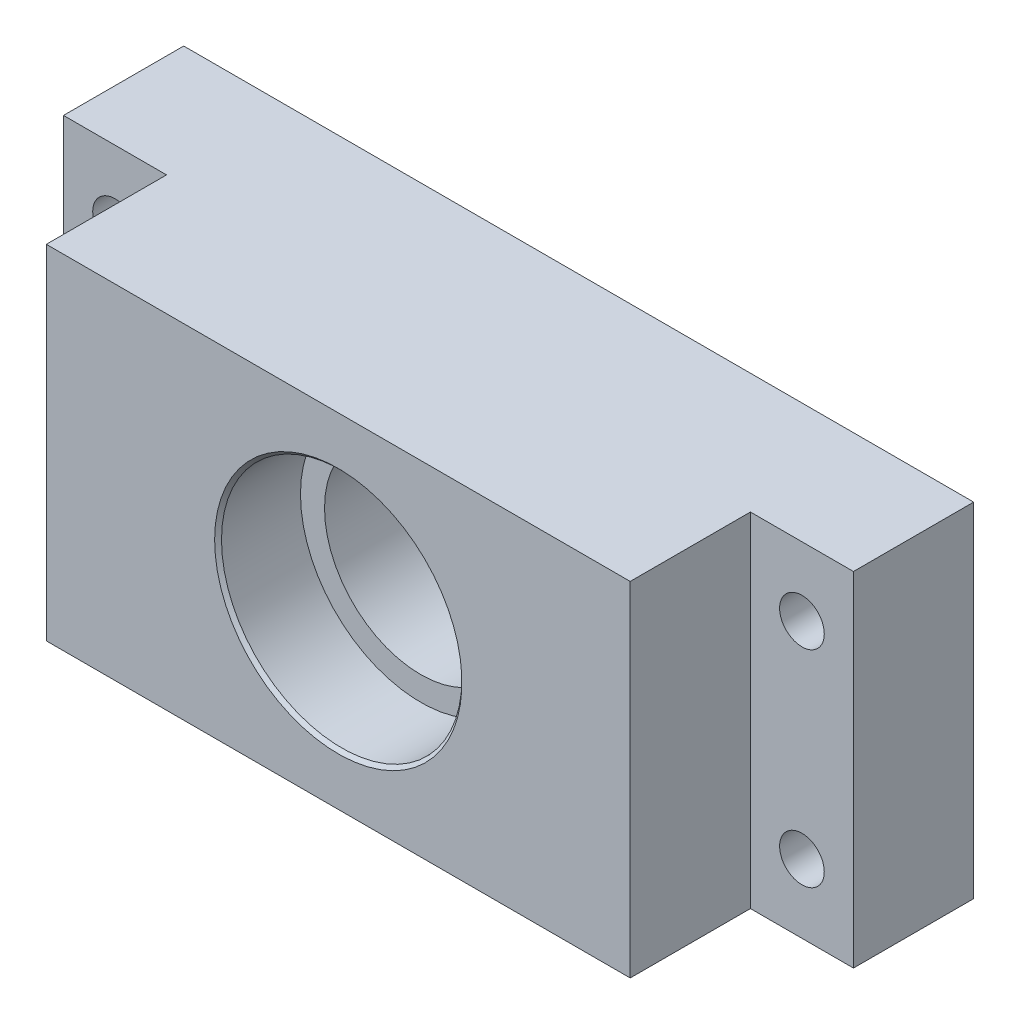
ISO-10303-21;
HEADER;
FILE_DESCRIPTION(('STEP AP214'),'2;1');
FILE_NAME('part.step','',(''),(''),'','','');
FILE_SCHEMA(('AUTOMOTIVE_DESIGN { 1 0 10303 214 1 1 1 1 }'));
ENDSEC;
DATA;
#1=APPLICATION_CONTEXT('core data for automotive mechanical design processes');
#2=APPLICATION_PROTOCOL_DEFINITION('international standard','automotive_design',2000,#1);
#3=PRODUCT_CONTEXT('',#1,'mechanical');
#4=PRODUCT('Part','Part','',(#3));
#5=PRODUCT_RELATED_PRODUCT_CATEGORY('part','',(#4));
#6=PRODUCT_DEFINITION_FORMATION('','',#4);
#7=PRODUCT_DEFINITION_CONTEXT('part definition',#1,'design');
#8=PRODUCT_DEFINITION('design','',#6,#7);
#9=PRODUCT_DEFINITION_SHAPE('','',#8);
#10=(LENGTH_UNIT() NAMED_UNIT(*) SI_UNIT(.MILLI.,.METRE.));
#11=(NAMED_UNIT(*) PLANE_ANGLE_UNIT() SI_UNIT($,.RADIAN.));
#12=(NAMED_UNIT(*) SI_UNIT($,.STERADIAN.) SOLID_ANGLE_UNIT());
#13=UNCERTAINTY_MEASURE_WITH_UNIT(LENGTH_MEASURE(1.E-05),#10,'distance_accuracy_value','');
#14=(GEOMETRIC_REPRESENTATION_CONTEXT(3) GLOBAL_UNCERTAINTY_ASSIGNED_CONTEXT((#13)) GLOBAL_UNIT_ASSIGNED_CONTEXT((#10,
#11,#12)) REPRESENTATION_CONTEXT('',''));
#15=CARTESIAN_POINT('',(0.,0.,0.));
#16=DIRECTION('',(0.,0.,1.));
#17=DIRECTION('',(1.,0.,0.));
#18=AXIS2_PLACEMENT_3D('',#15,#16,#17);
#19=CARTESIAN_POINT('',(57.5,-25.,35.));
#20=DIRECTION('',(-1.,0.,0.));
#21=DIRECTION('',(0.,0.,1.));
#22=AXIS2_PLACEMENT_3D('',#19,#20,#21);
#23=PLANE('',#22);
#24=DIRECTION('',(0.,1.,0.));
#25=VECTOR('',#24,1.);
#26=CARTESIAN_POINT('',(57.5,-25.,17.5));
#27=LINE('',#26,#25);
#28=CARTESIAN_POINT('',(57.5,-25.,17.5));
#29=VERTEX_POINT('',#28);
#30=CARTESIAN_POINT('',(57.5,25.,17.5));
#31=VERTEX_POINT('',#30);
#32=EDGE_CURVE('E113',#29,#31,#27,.T.);
#33=ORIENTED_EDGE('',*,*,#32,.F.);
#34=DIRECTION('',(0.,0.,-1.));
#35=VECTOR('',#34,1.);
#36=CARTESIAN_POINT('',(57.5,-25.,35.));
#37=LINE('',#36,#35);
#38=CARTESIAN_POINT('',(57.5,-25.,0.));
#39=VERTEX_POINT('',#38);
#40=EDGE_CURVE('E174',#29,#39,#37,.T.);
#41=ORIENTED_EDGE('',*,*,#40,.T.);
#42=DIRECTION('',(0.,1.,0.));
#43=VECTOR('',#42,1.);
#44=CARTESIAN_POINT('',(57.5,-25.,0.));
#45=LINE('',#44,#43);
#46=CARTESIAN_POINT('',(57.5,25.,0.));
#47=VERTEX_POINT('',#46);
#48=EDGE_CURVE('E136',#39,#47,#45,.T.);
#49=ORIENTED_EDGE('',*,*,#48,.T.);
#50=DIRECTION('',(0.,0.,-1.));
#51=VECTOR('',#50,1.);
#52=CARTESIAN_POINT('',(57.5,25.,35.));
#53=LINE('',#52,#51);
#54=EDGE_CURVE('E130',#31,#47,#53,.T.);
#55=ORIENTED_EDGE('',*,*,#54,.F.);
#56=EDGE_LOOP('',(#33,#41,#49,#55));
#57=FACE_BOUND('',#56,.T.);
#58=ADVANCED_FACE('F48',(#57),#23,.F.);
#59=CARTESIAN_POINT('',(50.,15.,35.));
#60=DIRECTION('',(0.,0.,-1.));
#61=DIRECTION('',(-1.,0.,0.));
#62=AXIS2_PLACEMENT_3D('',#59,#60,#61);
#63=CYLINDRICAL_SURFACE('',#62,3.25);
#64=CARTESIAN_POINT('',(50.,15.,0.));
#65=DIRECTION('',(0.,0.,-1.));
#66=DIRECTION('',(-1.,0.,0.));
#67=AXIS2_PLACEMENT_3D('',#64,#65,#66);
#68=CIRCLE('',#67,3.25);
#69=CARTESIAN_POINT('',(46.75,15.,0.));
#70=VERTEX_POINT('',#69);
#71=EDGE_CURVE('E236',#70,#70,#68,.T.);
#72=ORIENTED_EDGE('',*,*,#71,.T.);
#73=EDGE_LOOP('',(#72));
#74=FACE_BOUND('',#73,.T.);
#75=CARTESIAN_POINT('',(50.,15.,17.5));
#76=DIRECTION('',(0.,0.,1.));
#77=DIRECTION('',(1.,0.,0.));
#78=AXIS2_PLACEMENT_3D('',#75,#76,#77);
#79=CIRCLE('',#78,3.25);
#80=CARTESIAN_POINT('',(53.25,15.,17.5));
#81=VERTEX_POINT('',#80);
#82=EDGE_CURVE('E464',#81,#81,#79,.F.);
#83=ORIENTED_EDGE('',*,*,#82,.F.);
#84=EDGE_LOOP('',(#83));
#85=FACE_BOUND('',#84,.T.);
#86=ADVANCED_FACE('F263',(#74,#85),#63,.F.);
#87=CARTESIAN_POINT('',(50.,-15.,35.));
#88=DIRECTION('',(0.,0.,-1.));
#89=DIRECTION('',(-1.,0.,0.));
#90=AXIS2_PLACEMENT_3D('',#87,#88,#89);
#91=CYLINDRICAL_SURFACE('',#90,3.25);
#92=CARTESIAN_POINT('',(50.,-15.,0.));
#93=DIRECTION('',(0.,0.,-1.));
#94=DIRECTION('',(-1.,0.,0.));
#95=AXIS2_PLACEMENT_3D('',#92,#93,#94);
#96=CIRCLE('',#95,3.25);
#97=CARTESIAN_POINT('',(46.75,-15.,0.));
#98=VERTEX_POINT('',#97);
#99=EDGE_CURVE('E241',#98,#98,#96,.T.);
#100=ORIENTED_EDGE('',*,*,#99,.T.);
#101=EDGE_LOOP('',(#100));
#102=FACE_BOUND('',#101,.T.);
#103=CARTESIAN_POINT('',(50.,-15.,17.5));
#104=DIRECTION('',(0.,0.,1.));
#105=DIRECTION('',(1.,0.,0.));
#106=AXIS2_PLACEMENT_3D('',#103,#104,#105);
#107=CIRCLE('',#106,3.25);
#108=CARTESIAN_POINT('',(53.25,-15.,17.5));
#109=VERTEX_POINT('',#108);
#110=EDGE_CURVE('E461',#109,#109,#107,.F.);
#111=ORIENTED_EDGE('',*,*,#110,.F.);
#112=EDGE_LOOP('',(#111));
#113=FACE_BOUND('',#112,.T.);
#114=ADVANCED_FACE('F268',(#102,#113),#91,.F.);
#115=CARTESIAN_POINT('',(0.,0.,35.));
#116=DIRECTION('',(0.,0.,-1.));
#117=DIRECTION('',(-1.,0.,0.));
#118=AXIS2_PLACEMENT_3D('',#115,#116,#117);
#119=CYLINDRICAL_SURFACE('',#118,14.);
#120=CARTESIAN_POINT('',(0.,0.,23.));
#121=DIRECTION('',(0.,0.,1.));
#122=DIRECTION('',(1.,0.,0.));
#123=AXIS2_PLACEMENT_3D('',#120,#121,#122);
#124=CIRCLE('',#123,14.);
#125=CARTESIAN_POINT('',(14.,0.,23.));
#126=VERTEX_POINT('',#125);
#127=EDGE_CURVE('E151',#126,#126,#124,.T.);
#128=ORIENTED_EDGE('',*,*,#127,.T.);
#129=EDGE_LOOP('',(#128));
#130=FACE_BOUND('',#129,.T.);
#131=CARTESIAN_POINT('',(0.,0.,12.));
#132=DIRECTION('',(0.,0.,-1.));
#133=DIRECTION('',(-1.,0.,0.));
#134=AXIS2_PLACEMENT_3D('',#131,#132,#133);
#135=CIRCLE('',#134,14.);
#136=CARTESIAN_POINT('',(-14.,0.,12.));
#137=VERTEX_POINT('',#136);
#138=EDGE_CURVE('E232',#137,#137,#135,.T.);
#139=ORIENTED_EDGE('',*,*,#138,.T.);
#140=EDGE_LOOP('',(#139));
#141=FACE_BOUND('',#140,.T.);
#142=ADVANCED_FACE('F289',(#130,#141),#119,.F.);
#143=CARTESIAN_POINT('',(0.,0.,35.));
#144=DIRECTION('',(0.,0.,-1.));
#145=DIRECTION('',(-1.,0.,0.));
#146=AXIS2_PLACEMENT_3D('',#143,#144,#145);
#147=PLANE('',#146);
#148=CARTESIAN_POINT('',(0.,0.,35.));
#149=DIRECTION('',(0.,0.,-1.));
#150=DIRECTION('',(-1.,0.,0.));
#151=AXIS2_PLACEMENT_3D('',#148,#149,#150);
#152=CIRCLE('',#151,18.);
#153=CARTESIAN_POINT('',(-18.,0.,35.));
#154=VERTEX_POINT('',#153);
#155=EDGE_CURVE('E144',#154,#154,#152,.T.);
#156=ORIENTED_EDGE('',*,*,#155,.T.);
#157=EDGE_LOOP('',(#156));
#158=FACE_BOUND('',#157,.T.);
#159=DIRECTION('',(1.,0.,0.));
#160=VECTOR('',#159,1.);
#161=CARTESIAN_POINT('',(-57.5,-25.,35.));
#162=LINE('',#161,#160);
#163=CARTESIAN_POINT('',(-42.5,-25.,35.));
#164=VERTEX_POINT('',#163);
#165=CARTESIAN_POINT('',(42.5,-25.,35.));
#166=VERTEX_POINT('',#165);
#167=EDGE_CURVE('E162',#164,#166,#162,.T.);
#168=ORIENTED_EDGE('',*,*,#167,.T.);
#169=DIRECTION('',(0.,-1.,0.));
#170=VECTOR('',#169,1.);
#171=CARTESIAN_POINT('',(42.5,-25.,35.));
#172=LINE('',#171,#170);
#173=CARTESIAN_POINT('',(42.5,25.,35.));
#174=VERTEX_POINT('',#173);
#175=EDGE_CURVE('E124',#174,#166,#172,.T.);
#176=ORIENTED_EDGE('',*,*,#175,.F.);
#177=DIRECTION('',(-1.,0.,0.));
#178=VECTOR('',#177,1.);
#179=CARTESIAN_POINT('',(-57.5,25.,35.));
#180=LINE('',#179,#178);
#181=CARTESIAN_POINT('',(-42.5,25.,35.));
#182=VERTEX_POINT('',#181);
#183=EDGE_CURVE('E173',#174,#182,#180,.T.);
#184=ORIENTED_EDGE('',*,*,#183,.T.);
#185=DIRECTION('',(0.,1.,0.));
#186=VECTOR('',#185,1.);
#187=CARTESIAN_POINT('',(-42.5,-25.,35.));
#188=LINE('',#187,#186);
#189=EDGE_CURVE('E204',#164,#182,#188,.T.);
#190=ORIENTED_EDGE('',*,*,#189,.F.);
#191=EDGE_LOOP('',(#168,#176,#184,#190));
#192=FACE_BOUND('',#191,.T.);
#193=ADVANCED_FACE('F225',(#158,#192),#147,.F.);
#194=CARTESIAN_POINT('',(0.,0.,0.));
#195=DIRECTION('',(0.,0.,-1.));
#196=DIRECTION('',(-1.,0.,0.));
#197=AXIS2_PLACEMENT_3D('',#194,#195,#196);
#198=PLANE('',#197);
#199=CARTESIAN_POINT('',(0.,0.,0.));
#200=DIRECTION('',(0.,0.,-1.));
#201=DIRECTION('',(-1.,0.,0.));
#202=AXIS2_PLACEMENT_3D('',#199,#200,#201);
#203=CIRCLE('',#202,18.);
#204=CARTESIAN_POINT('',(-18.,0.,0.));
#205=VERTEX_POINT('',#204);
#206=EDGE_CURVE('E12',#205,#205,#203,.F.);
#207=ORIENTED_EDGE('',*,*,#206,.T.);
#208=EDGE_LOOP('',(#207));
#209=FACE_BOUND('',#208,.T.);
#210=ORIENTED_EDGE('',*,*,#99,.F.);
#211=EDGE_LOOP('',(#210));
#212=FACE_BOUND('',#211,.T.);
#213=CARTESIAN_POINT('',(-50.,15.,0.));
#214=DIRECTION('',(0.,0.,-1.));
#215=DIRECTION('',(-1.,0.,0.));
#216=AXIS2_PLACEMENT_3D('',#213,#214,#215);
#217=CIRCLE('',#216,3.25);
#218=CARTESIAN_POINT('',(-53.25,15.,0.));
#219=VERTEX_POINT('',#218);
#220=EDGE_CURVE('E242',#219,#219,#217,.T.);
#221=ORIENTED_EDGE('',*,*,#220,.F.);
#222=EDGE_LOOP('',(#221));
#223=FACE_BOUND('',#222,.T.);
#224=CARTESIAN_POINT('',(-50.,-15.,0.));
#225=DIRECTION('',(0.,0.,-1.));
#226=DIRECTION('',(-1.,0.,0.));
#227=AXIS2_PLACEMENT_3D('',#224,#225,#226);
#228=CIRCLE('',#227,3.25);
#229=CARTESIAN_POINT('',(-53.25,-15.,0.));
#230=VERTEX_POINT('',#229);
#231=EDGE_CURVE('E479',#230,#230,#228,.T.);
#232=ORIENTED_EDGE('',*,*,#231,.F.);
#233=EDGE_LOOP('',(#232));
#234=FACE_BOUND('',#233,.T.);
#235=ORIENTED_EDGE('',*,*,#71,.F.);
#236=EDGE_LOOP('',(#235));
#237=FACE_BOUND('',#236,.T.);
#238=ORIENTED_EDGE('',*,*,#48,.F.);
#239=DIRECTION('',(1.,0.,0.));
#240=VECTOR('',#239,1.);
#241=CARTESIAN_POINT('',(-57.5,-25.,0.));
#242=LINE('',#241,#240);
#243=CARTESIAN_POINT('',(-57.5,-25.,0.));
#244=VERTEX_POINT('',#243);
#245=EDGE_CURVE('E168',#244,#39,#242,.T.);
#246=ORIENTED_EDGE('',*,*,#245,.F.);
#247=DIRECTION('',(0.,-1.,0.));
#248=VECTOR('',#247,1.);
#249=CARTESIAN_POINT('',(-57.5,-25.,0.));
#250=LINE('',#249,#248);
#251=CARTESIAN_POINT('',(-57.5,25.,0.));
#252=VERTEX_POINT('',#251);
#253=EDGE_CURVE('E165',#252,#244,#250,.T.);
#254=ORIENTED_EDGE('',*,*,#253,.F.);
#255=DIRECTION('',(-1.,0.,0.));
#256=VECTOR('',#255,1.);
#257=CARTESIAN_POINT('',(-57.5,25.,0.));
#258=LINE('',#257,#256);
#259=EDGE_CURVE('E161',#47,#252,#258,.T.);
#260=ORIENTED_EDGE('',*,*,#259,.F.);
#261=EDGE_LOOP('',(#238,#246,#254,#260));
#262=FACE_BOUND('',#261,.T.);
#263=ADVANCED_FACE('F189',(#209,#212,#223,#234,#237,#262),#198,.T.);
#264=CARTESIAN_POINT('',(-57.5,25.,35.));
#265=DIRECTION('',(0.,-1.,0.));
#266=DIRECTION('',(0.,0.,-1.));
#267=AXIS2_PLACEMENT_3D('',#264,#265,#266);
#268=PLANE('',#267);
#269=ORIENTED_EDGE('',*,*,#183,.F.);
#270=DIRECTION('',(0.,0.,1.));
#271=VECTOR('',#270,1.);
#272=CARTESIAN_POINT('',(42.5,25.,17.5));
#273=LINE('',#272,#271);
#274=CARTESIAN_POINT('',(42.5,25.,17.5));
#275=VERTEX_POINT('',#274);
#276=EDGE_CURVE('E132',#275,#174,#273,.T.);
#277=ORIENTED_EDGE('',*,*,#276,.F.);
#278=DIRECTION('',(-1.,0.,0.));
#279=VECTOR('',#278,1.);
#280=CARTESIAN_POINT('',(57.5,25.,17.5));
#281=LINE('',#280,#279);
#282=EDGE_CURVE('E117',#31,#275,#281,.T.);
#283=ORIENTED_EDGE('',*,*,#282,.F.);
#284=ORIENTED_EDGE('',*,*,#54,.T.);
#285=ORIENTED_EDGE('',*,*,#259,.T.);
#286=DIRECTION('',(0.,0.,-1.));
#287=VECTOR('',#286,1.);
#288=CARTESIAN_POINT('',(-57.5,25.,35.));
#289=LINE('',#288,#287);
#290=CARTESIAN_POINT('',(-57.5,25.,17.5));
#291=VERTEX_POINT('',#290);
#292=EDGE_CURVE('E139',#291,#252,#289,.T.);
#293=ORIENTED_EDGE('',*,*,#292,.F.);
#294=DIRECTION('',(-1.,0.,0.));
#295=VECTOR('',#294,1.);
#296=CARTESIAN_POINT('',(-57.5,25.,17.5));
#297=LINE('',#296,#295);
#298=CARTESIAN_POINT('',(-42.5,25.,17.5));
#299=VERTEX_POINT('',#298);
#300=EDGE_CURVE('E192',#299,#291,#297,.T.);
#301=ORIENTED_EDGE('',*,*,#300,.F.);
#302=DIRECTION('',(0.,0.,1.));
#303=VECTOR('',#302,1.);
#304=CARTESIAN_POINT('',(-42.5,25.,17.5));
#305=LINE('',#304,#303);
#306=EDGE_CURVE('E193',#299,#182,#305,.T.);
#307=ORIENTED_EDGE('',*,*,#306,.T.);
#308=EDGE_LOOP('',(#269,#277,#283,#284,#285,#293,#301,#307));
#309=FACE_BOUND('',#308,.T.);
#310=ADVANCED_FACE('F128',(#309),#268,.F.);
#311=CARTESIAN_POINT('',(-57.5,-25.,35.));
#312=DIRECTION('',(1.,0.,0.));
#313=DIRECTION('',(0.,0.,-1.));
#314=AXIS2_PLACEMENT_3D('',#311,#312,#313);
#315=PLANE('',#314);
#316=DIRECTION('',(0.,0.,-1.));
#317=VECTOR('',#316,1.);
#318=CARTESIAN_POINT('',(-57.5,-25.,35.));
#319=LINE('',#318,#317);
#320=CARTESIAN_POINT('',(-57.5,-25.,17.5));
#321=VERTEX_POINT('',#320);
#322=EDGE_CURVE('E146',#321,#244,#319,.T.);
#323=ORIENTED_EDGE('',*,*,#322,.F.);
#324=DIRECTION('',(0.,-1.,0.));
#325=VECTOR('',#324,1.);
#326=CARTESIAN_POINT('',(-57.5,-25.,17.5));
#327=LINE('',#326,#325);
#328=EDGE_CURVE('E72',#291,#321,#327,.T.);
#329=ORIENTED_EDGE('',*,*,#328,.F.);
#330=ORIENTED_EDGE('',*,*,#292,.T.);
#331=ORIENTED_EDGE('',*,*,#253,.T.);
#332=EDGE_LOOP('',(#323,#329,#330,#331));
#333=FACE_BOUND('',#332,.T.);
#334=ADVANCED_FACE('F186',(#333),#315,.F.);
#335=CARTESIAN_POINT('',(-57.5,-25.,35.));
#336=DIRECTION('',(0.,1.,0.));
#337=DIRECTION('',(0.,0.,1.));
#338=AXIS2_PLACEMENT_3D('',#335,#336,#337);
#339=PLANE('',#338);
#340=DIRECTION('',(1.,0.,0.));
#341=VECTOR('',#340,1.);
#342=CARTESIAN_POINT('',(57.5,-25.,17.5));
#343=LINE('',#342,#341);
#344=CARTESIAN_POINT('',(42.5,-25.,17.5));
#345=VERTEX_POINT('',#344);
#346=EDGE_CURVE('E120',#345,#29,#343,.T.);
#347=ORIENTED_EDGE('',*,*,#346,.F.);
#348=DIRECTION('',(0.,0.,1.));
#349=VECTOR('',#348,1.);
#350=CARTESIAN_POINT('',(42.5,-25.,17.5));
#351=LINE('',#350,#349);
#352=EDGE_CURVE('E459',#345,#166,#351,.T.);
#353=ORIENTED_EDGE('',*,*,#352,.T.);
#354=ORIENTED_EDGE('',*,*,#167,.F.);
#355=DIRECTION('',(0.,0.,1.));
#356=VECTOR('',#355,1.);
#357=CARTESIAN_POINT('',(-42.5,-25.,17.5));
#358=LINE('',#357,#356);
#359=CARTESIAN_POINT('',(-42.5,-25.,17.5));
#360=VERTEX_POINT('',#359);
#361=EDGE_CURVE('E196',#360,#164,#358,.T.);
#362=ORIENTED_EDGE('',*,*,#361,.F.);
#363=DIRECTION('',(1.,0.,0.));
#364=VECTOR('',#363,1.);
#365=CARTESIAN_POINT('',(-57.5,-25.,17.5));
#366=LINE('',#365,#364);
#367=EDGE_CURVE('E183',#321,#360,#366,.T.);
#368=ORIENTED_EDGE('',*,*,#367,.F.);
#369=ORIENTED_EDGE('',*,*,#322,.T.);
#370=ORIENTED_EDGE('',*,*,#245,.T.);
#371=ORIENTED_EDGE('',*,*,#40,.F.);
#372=EDGE_LOOP('',(#347,#353,#354,#362,#368,#369,#370,#371));
#373=FACE_BOUND('',#372,.T.);
#374=ADVANCED_FACE('F180',(#373),#339,.F.);
#375=CARTESIAN_POINT('',(0.,0.,23.));
#376=DIRECTION('',(0.,0.,1.));
#377=DIRECTION('',(1.,0.,0.));
#378=AXIS2_PLACEMENT_3D('',#375,#376,#377);
#379=CYLINDRICAL_SURFACE('',#378,17.5);
#380=CARTESIAN_POINT('',(0.,0.,34.5));
#381=DIRECTION('',(0.,0.,-1.));
#382=DIRECTION('',(-1.,0.,0.));
#383=AXIS2_PLACEMENT_3D('',#380,#381,#382);
#384=CIRCLE('',#383,17.5);
#385=CARTESIAN_POINT('',(-17.5,0.,34.5));
#386=VERTEX_POINT('',#385);
#387=EDGE_CURVE('E138',#386,#386,#384,.F.);
#388=ORIENTED_EDGE('',*,*,#387,.T.);
#389=EDGE_LOOP('',(#388));
#390=FACE_BOUND('',#389,.T.);
#391=CARTESIAN_POINT('',(0.,0.,23.));
#392=DIRECTION('',(0.,0.,1.));
#393=DIRECTION('',(1.,0.,0.));
#394=AXIS2_PLACEMENT_3D('',#391,#392,#393);
#395=CIRCLE('',#394,17.5);
#396=CARTESIAN_POINT('',(17.5,0.,23.));
#397=VERTEX_POINT('',#396);
#398=EDGE_CURVE('E228',#397,#397,#395,.T.);
#399=ORIENTED_EDGE('',*,*,#398,.F.);
#400=EDGE_LOOP('',(#399));
#401=FACE_BOUND('',#400,.T.);
#402=ADVANCED_FACE('F283',(#390,#401),#379,.F.);
#403=CARTESIAN_POINT('',(0.,0.,23.));
#404=DIRECTION('',(0.,0.,1.));
#405=DIRECTION('',(1.,0.,0.));
#406=AXIS2_PLACEMENT_3D('',#403,#404,#405);
#407=PLANE('',#406);
#408=ORIENTED_EDGE('',*,*,#127,.F.);
#409=EDGE_LOOP('',(#408));
#410=FACE_BOUND('',#409,.T.);
#411=ORIENTED_EDGE('',*,*,#398,.T.);
#412=EDGE_LOOP('',(#411));
#413=FACE_BOUND('',#412,.T.);
#414=ADVANCED_FACE('F296',(#410,#413),#407,.T.);
#415=CARTESIAN_POINT('',(0.,0.,12.));
#416=DIRECTION('',(0.,0.,-1.));
#417=DIRECTION('',(-1.,0.,0.));
#418=AXIS2_PLACEMENT_3D('',#415,#416,#417);
#419=CYLINDRICAL_SURFACE('',#418,17.5);
#420=CARTESIAN_POINT('',(0.,0.,0.5));
#421=DIRECTION('',(0.,0.,-1.));
#422=DIRECTION('',(-1.,0.,0.));
#423=AXIS2_PLACEMENT_3D('',#420,#421,#422);
#424=CIRCLE('',#423,17.5);
#425=CARTESIAN_POINT('',(-17.5,0.,0.5));
#426=VERTEX_POINT('',#425);
#427=EDGE_CURVE('E57',#426,#426,#424,.T.);
#428=ORIENTED_EDGE('',*,*,#427,.T.);
#429=EDGE_LOOP('',(#428));
#430=FACE_BOUND('',#429,.T.);
#431=CARTESIAN_POINT('',(0.,0.,12.));
#432=DIRECTION('',(0.,0.,-1.));
#433=DIRECTION('',(-1.,0.,0.));
#434=AXIS2_PLACEMENT_3D('',#431,#432,#433);
#435=CIRCLE('',#434,17.5);
#436=CARTESIAN_POINT('',(-17.5,0.,12.));
#437=VERTEX_POINT('',#436);
#438=EDGE_CURVE('E233',#437,#437,#435,.T.);
#439=ORIENTED_EDGE('',*,*,#438,.F.);
#440=EDGE_LOOP('',(#439));
#441=FACE_BOUND('',#440,.T.);
#442=ADVANCED_FACE('F251',(#430,#441),#419,.F.);
#443=CARTESIAN_POINT('',(0.,0.,12.));
#444=DIRECTION('',(0.,0.,-1.));
#445=DIRECTION('',(-1.,0.,0.));
#446=AXIS2_PLACEMENT_3D('',#443,#444,#445);
#447=PLANE('',#446);
#448=ORIENTED_EDGE('',*,*,#138,.F.);
#449=EDGE_LOOP('',(#448));
#450=FACE_BOUND('',#449,.T.);
#451=ORIENTED_EDGE('',*,*,#438,.T.);
#452=EDGE_LOOP('',(#451));
#453=FACE_BOUND('',#452,.T.);
#454=ADVANCED_FACE('F303',(#450,#453),#447,.T.);
#455=CARTESIAN_POINT('',(-50.,-15.,35.));
#456=DIRECTION('',(0.,0.,-1.));
#457=DIRECTION('',(-1.,0.,0.));
#458=AXIS2_PLACEMENT_3D('',#455,#456,#457);
#459=CYLINDRICAL_SURFACE('',#458,3.25);
#460=CARTESIAN_POINT('',(-50.,-15.,17.5));
#461=DIRECTION('',(0.,0.,-1.));
#462=DIRECTION('',(-1.,0.,0.));
#463=AXIS2_PLACEMENT_3D('',#460,#461,#462);
#464=CIRCLE('',#463,3.25);
#465=CARTESIAN_POINT('',(-53.25,-15.,17.5));
#466=VERTEX_POINT('',#465);
#467=EDGE_CURVE('E475',#466,#466,#464,.F.);
#468=ORIENTED_EDGE('',*,*,#467,.T.);
#469=EDGE_LOOP('',(#468));
#470=FACE_BOUND('',#469,.T.);
#471=ORIENTED_EDGE('',*,*,#231,.T.);
#472=EDGE_LOOP('',(#471));
#473=FACE_BOUND('',#472,.T.);
#474=ADVANCED_FACE('F305',(#470,#473),#459,.F.);
#475=CARTESIAN_POINT('',(-50.,15.,35.));
#476=DIRECTION('',(0.,0.,-1.));
#477=DIRECTION('',(-1.,0.,0.));
#478=AXIS2_PLACEMENT_3D('',#475,#476,#477);
#479=CYLINDRICAL_SURFACE('',#478,3.25);
#480=CARTESIAN_POINT('',(-50.,15.,17.5));
#481=DIRECTION('',(0.,0.,-1.));
#482=DIRECTION('',(-1.,0.,0.));
#483=AXIS2_PLACEMENT_3D('',#480,#481,#482);
#484=CIRCLE('',#483,3.25);
#485=CARTESIAN_POINT('',(-53.25,15.,17.5));
#486=VERTEX_POINT('',#485);
#487=EDGE_CURVE('E471',#486,#486,#484,.F.);
#488=ORIENTED_EDGE('',*,*,#487,.T.);
#489=EDGE_LOOP('',(#488));
#490=FACE_BOUND('',#489,.T.);
#491=ORIENTED_EDGE('',*,*,#220,.T.);
#492=EDGE_LOOP('',(#491));
#493=FACE_BOUND('',#492,.T.);
#494=ADVANCED_FACE('F308',(#490,#493),#479,.F.);
#495=CARTESIAN_POINT('',(0.,0.,17.5));
#496=DIRECTION('',(0.,0.,1.));
#497=DIRECTION('',(1.,0.,0.));
#498=AXIS2_PLACEMENT_3D('',#495,#496,#497);
#499=PLANE('',#498);
#500=ORIENTED_EDGE('',*,*,#32,.T.);
#501=ORIENTED_EDGE('',*,*,#282,.T.);
#502=DIRECTION('',(0.,-1.,0.));
#503=VECTOR('',#502,1.);
#504=CARTESIAN_POINT('',(42.5,-25.,17.5));
#505=LINE('',#504,#503);
#506=EDGE_CURVE('E64',#275,#345,#505,.T.);
#507=ORIENTED_EDGE('',*,*,#506,.T.);
#508=ORIENTED_EDGE('',*,*,#346,.T.);
#509=EDGE_LOOP('',(#500,#501,#507,#508));
#510=FACE_BOUND('',#509,.T.);
#511=ORIENTED_EDGE('',*,*,#110,.T.);
#512=EDGE_LOOP('',(#511));
#513=FACE_BOUND('',#512,.T.);
#514=ORIENTED_EDGE('',*,*,#82,.T.);
#515=EDGE_LOOP('',(#514));
#516=FACE_BOUND('',#515,.T.);
#517=ADVANCED_FACE('F115',(#510,#513,#516),#499,.T.);
#518=CARTESIAN_POINT('',(42.5,-25.,17.5));
#519=DIRECTION('',(-1.,0.,0.));
#520=DIRECTION('',(0.,0.,1.));
#521=AXIS2_PLACEMENT_3D('',#518,#519,#520);
#522=PLANE('',#521);
#523=ORIENTED_EDGE('',*,*,#175,.T.);
#524=ORIENTED_EDGE('',*,*,#352,.F.);
#525=ORIENTED_EDGE('',*,*,#506,.F.);
#526=ORIENTED_EDGE('',*,*,#276,.T.);
#527=EDGE_LOOP('',(#523,#524,#525,#526));
#528=FACE_BOUND('',#527,.T.);
#529=ADVANCED_FACE('F322',(#528),#522,.F.);
#530=CARTESIAN_POINT('',(0.,0.,17.5));
#531=DIRECTION('',(0.,0.,-1.));
#532=DIRECTION('',(-1.,0.,0.));
#533=AXIS2_PLACEMENT_3D('',#530,#531,#532);
#534=PLANE('',#533);
#535=ORIENTED_EDGE('',*,*,#487,.F.);
#536=EDGE_LOOP('',(#535));
#537=FACE_BOUND('',#536,.T.);
#538=ORIENTED_EDGE('',*,*,#328,.T.);
#539=ORIENTED_EDGE('',*,*,#367,.T.);
#540=DIRECTION('',(0.,1.,0.));
#541=VECTOR('',#540,1.);
#542=CARTESIAN_POINT('',(-42.5,-25.,17.5));
#543=LINE('',#542,#541);
#544=EDGE_CURVE('E197',#360,#299,#543,.T.);
#545=ORIENTED_EDGE('',*,*,#544,.T.);
#546=ORIENTED_EDGE('',*,*,#300,.T.);
#547=EDGE_LOOP('',(#538,#539,#545,#546));
#548=FACE_BOUND('',#547,.T.);
#549=ORIENTED_EDGE('',*,*,#467,.F.);
#550=EDGE_LOOP('',(#549));
#551=FACE_BOUND('',#550,.T.);
#552=ADVANCED_FACE('F216',(#537,#548,#551),#534,.F.);
#553=CARTESIAN_POINT('',(-42.5,-25.,17.5));
#554=DIRECTION('',(1.,0.,0.));
#555=DIRECTION('',(0.,0.,-1.));
#556=AXIS2_PLACEMENT_3D('',#553,#554,#555);
#557=PLANE('',#556);
#558=ORIENTED_EDGE('',*,*,#189,.T.);
#559=ORIENTED_EDGE('',*,*,#306,.F.);
#560=ORIENTED_EDGE('',*,*,#544,.F.);
#561=ORIENTED_EDGE('',*,*,#361,.T.);
#562=EDGE_LOOP('',(#558,#559,#560,#561));
#563=FACE_BOUND('',#562,.T.);
#564=ADVANCED_FACE('F223',(#563),#557,.F.);
#565=CARTESIAN_POINT('',(0.,0.,34.5));
#566=DIRECTION('',(0.,0.,1.));
#567=DIRECTION('',(1.,0.,0.));
#568=AXIS2_PLACEMENT_3D('',#565,#566,#567);
#569=CONICAL_SURFACE('',#568,17.5,0.785398163397452);
#570=ORIENTED_EDGE('',*,*,#155,.F.);
#571=EDGE_LOOP('',(#570));
#572=FACE_BOUND('',#571,.T.);
#573=ORIENTED_EDGE('',*,*,#387,.F.);
#574=EDGE_LOOP('',(#573));
#575=FACE_BOUND('',#574,.T.);
#576=ADVANCED_FACE('F255',(#572,#575),#569,.F.);
#577=CARTESIAN_POINT('',(0.,0.,0.5));
#578=DIRECTION('',(0.,0.,-1.));
#579=DIRECTION('',(-1.,0.,0.));
#580=AXIS2_PLACEMENT_3D('',#577,#578,#579);
#581=CONICAL_SURFACE('',#580,17.5,0.785398163397445);
#582=ORIENTED_EDGE('',*,*,#206,.F.);
#583=EDGE_LOOP('',(#582));
#584=FACE_BOUND('',#583,.T.);
#585=ORIENTED_EDGE('',*,*,#427,.F.);
#586=EDGE_LOOP('',(#585));
#587=FACE_BOUND('',#586,.T.);
#588=ADVANCED_FACE('F51',(#584,#587),#581,.F.);
#589=CLOSED_SHELL('',(#58,#86,#114,#142,#193,#263,#310,#334,#374,#402,#414,#442,#454,#474,#494,
#517,#529,#552,#564,#576,#588));
#590=MANIFOLD_SOLID_BREP('B2',#589);
#591=ADVANCED_BREP_SHAPE_REPRESENTATION('',(#18,#590),#14);
#592=SHAPE_DEFINITION_REPRESENTATION(#9,#591);
ENDSEC;
END-ISO-10303-21;
